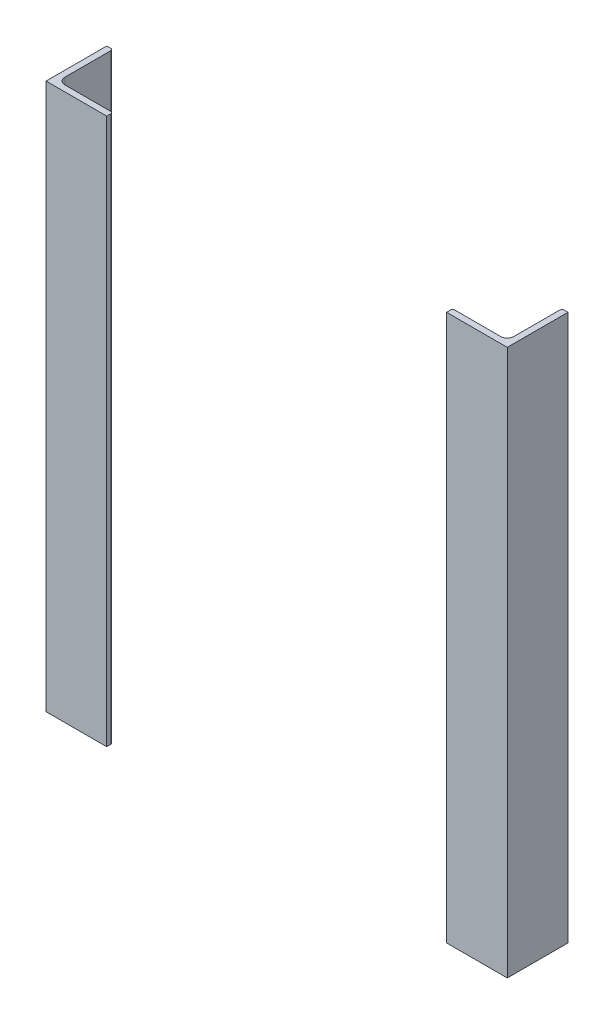
ISO-10303-21;
HEADER;
FILE_DESCRIPTION(('STEP AP214'),'2;1');
FILE_NAME('part.step','',(''),(''),'','','');
FILE_SCHEMA(('AUTOMOTIVE_DESIGN { 1 0 10303 214 1 1 1 1 }'));
ENDSEC;
DATA;
#1=APPLICATION_CONTEXT('core data for automotive mechanical design processes');
#2=APPLICATION_PROTOCOL_DEFINITION('international standard','automotive_design',2000,#1);
#3=PRODUCT_CONTEXT('',#1,'mechanical');
#4=PRODUCT('Part','Part','',(#3));
#5=PRODUCT_RELATED_PRODUCT_CATEGORY('part','',(#4));
#6=PRODUCT_DEFINITION_FORMATION('','',#4);
#7=PRODUCT_DEFINITION_CONTEXT('part definition',#1,'design');
#8=PRODUCT_DEFINITION('design','',#6,#7);
#9=PRODUCT_DEFINITION_SHAPE('','',#8);
#10=(LENGTH_UNIT() NAMED_UNIT(*) SI_UNIT(.MILLI.,.METRE.));
#11=(NAMED_UNIT(*) PLANE_ANGLE_UNIT() SI_UNIT($,.RADIAN.));
#12=(NAMED_UNIT(*) SI_UNIT($,.STERADIAN.) SOLID_ANGLE_UNIT());
#13=UNCERTAINTY_MEASURE_WITH_UNIT(LENGTH_MEASURE(1.E-05),#10,'distance_accuracy_value','');
#14=(GEOMETRIC_REPRESENTATION_CONTEXT(3) GLOBAL_UNCERTAINTY_ASSIGNED_CONTEXT((#13)) GLOBAL_UNIT_ASSIGNED_CONTEXT((#10,
#11,#12)) REPRESENTATION_CONTEXT('',''));
#15=CARTESIAN_POINT('',(0.,0.,0.));
#16=DIRECTION('',(0.,0.,1.));
#17=DIRECTION('',(1.,0.,0.));
#18=AXIS2_PLACEMENT_3D('',#15,#16,#17);
#19=CARTESIAN_POINT('',(190.000000000001,-450.,-50.));
#20=DIRECTION('',(0.,0.,1.));
#21=DIRECTION('',(1.,0.,0.));
#22=AXIS2_PLACEMENT_3D('',#19,#20,#21);
#23=PLANE('',#22);
#24=DIRECTION('',(1.,0.,0.));
#25=VECTOR('',#24,1.);
#26=CARTESIAN_POINT('',(190.000000000001,0.,-50.));
#27=LINE('',#26,#25);
#28=CARTESIAN_POINT('',(186.666700000001,0.,-50.));
#29=VERTEX_POINT('',#28);
#30=CARTESIAN_POINT('',(190.000000000001,0.,-50.));
#31=VERTEX_POINT('',#30);
#32=EDGE_CURVE('E183',#29,#31,#27,.T.);
#33=ORIENTED_EDGE('',*,*,#32,.T.);
#34=DIRECTION('',(0.,1.,0.));
#35=VECTOR('',#34,1.);
#36=CARTESIAN_POINT('',(190.000000000001,-450.,-50.));
#37=LINE('',#36,#35);
#38=CARTESIAN_POINT('',(190.000000000001,-450.,-50.));
#39=VERTEX_POINT('',#38);
#40=EDGE_CURVE('E14',#39,#31,#37,.T.);
#41=ORIENTED_EDGE('',*,*,#40,.F.);
#42=DIRECTION('',(1.,0.,0.));
#43=VECTOR('',#42,1.);
#44=CARTESIAN_POINT('',(190.000000000001,-450.,-50.));
#45=LINE('',#44,#43);
#46=CARTESIAN_POINT('',(186.666700000001,-450.,-50.));
#47=VERTEX_POINT('',#46);
#48=EDGE_CURVE('E199',#47,#39,#45,.T.);
#49=ORIENTED_EDGE('',*,*,#48,.F.);
#50=DIRECTION('',(0.,1.,0.));
#51=VECTOR('',#50,1.);
#52=CARTESIAN_POINT('',(186.666700000001,-450.,-50.));
#53=LINE('',#52,#51);
#54=EDGE_CURVE('E179',#47,#29,#53,.T.);
#55=ORIENTED_EDGE('',*,*,#54,.T.);
#56=EDGE_LOOP('',(#33,#41,#49,#55));
#57=FACE_BOUND('',#56,.T.);
#58=ADVANCED_FACE('F81',(#57),#23,.F.);
#59=CARTESIAN_POINT('',(190.000000000001,-450.,-50.));
#60=DIRECTION('',(-1.,0.,0.));
#61=DIRECTION('',(0.,0.,1.));
#62=AXIS2_PLACEMENT_3D('',#59,#60,#61);
#63=PLANE('',#62);
#64=DIRECTION('',(0.,0.,1.));
#65=VECTOR('',#64,1.);
#66=CARTESIAN_POINT('',(190.000000000001,0.,-50.));
#67=LINE('',#66,#65);
#68=CARTESIAN_POINT('',(190.,0.,0.));
#69=VERTEX_POINT('',#68);
#70=EDGE_CURVE('E186',#31,#69,#67,.T.);
#71=ORIENTED_EDGE('',*,*,#70,.T.);
#72=DIRECTION('',(0.,1.,0.));
#73=VECTOR('',#72,1.);
#74=CARTESIAN_POINT('',(190.,-450.,0.));
#75=LINE('',#74,#73);
#76=CARTESIAN_POINT('',(190.,-450.,0.));
#77=VERTEX_POINT('',#76);
#78=EDGE_CURVE('E89',#77,#69,#75,.T.);
#79=ORIENTED_EDGE('',*,*,#78,.F.);
#80=DIRECTION('',(0.,0.,1.));
#81=VECTOR('',#80,1.);
#82=CARTESIAN_POINT('',(190.000000000001,-450.,-50.));
#83=LINE('',#82,#81);
#84=EDGE_CURVE('E143',#39,#77,#83,.T.);
#85=ORIENTED_EDGE('',*,*,#84,.F.);
#86=ORIENTED_EDGE('',*,*,#40,.T.);
#87=EDGE_LOOP('',(#71,#79,#85,#86));
#88=FACE_BOUND('',#87,.T.);
#89=ADVANCED_FACE('F242',(#88),#63,.F.);
#90=CARTESIAN_POINT('',(190.,-450.,0.));
#91=DIRECTION('',(0.,0.,-1.));
#92=DIRECTION('',(-1.,0.,0.));
#93=AXIS2_PLACEMENT_3D('',#90,#91,#92);
#94=PLANE('',#93);
#95=DIRECTION('',(-1.,0.,0.));
#96=VECTOR('',#95,1.);
#97=CARTESIAN_POINT('',(190.,0.,0.));
#98=LINE('',#97,#96);
#99=CARTESIAN_POINT('',(140.,0.,-5.27355936696949E-13));
#100=VERTEX_POINT('',#99);
#101=EDGE_CURVE('E188',#69,#100,#98,.T.);
#102=ORIENTED_EDGE('',*,*,#101,.T.);
#103=DIRECTION('',(0.,1.,0.));
#104=VECTOR('',#103,1.);
#105=CARTESIAN_POINT('',(140.,-450.,-5.27355936696949E-13));
#106=LINE('',#105,#104);
#107=CARTESIAN_POINT('',(140.,-450.,-5.27355936696949E-13));
#108=VERTEX_POINT('',#107);
#109=EDGE_CURVE('E209',#108,#100,#106,.T.);
#110=ORIENTED_EDGE('',*,*,#109,.F.);
#111=DIRECTION('',(-1.,0.,0.));
#112=VECTOR('',#111,1.);
#113=CARTESIAN_POINT('',(190.,-450.,0.));
#114=LINE('',#113,#112);
#115=EDGE_CURVE('E217',#77,#108,#114,.T.);
#116=ORIENTED_EDGE('',*,*,#115,.F.);
#117=ORIENTED_EDGE('',*,*,#78,.T.);
#118=EDGE_LOOP('',(#102,#110,#116,#117));
#119=FACE_BOUND('',#118,.T.);
#120=ADVANCED_FACE('F215',(#119),#94,.F.);
#121=CARTESIAN_POINT('',(140.,-450.,-5.27355936696949E-13));
#122=DIRECTION('',(1.,0.,0.));
#123=DIRECTION('',(0.,0.,-1.));
#124=AXIS2_PLACEMENT_3D('',#121,#122,#123);
#125=PLANE('',#124);
#126=DIRECTION('',(0.,0.,-1.));
#127=VECTOR('',#126,1.);
#128=CARTESIAN_POINT('',(140.,0.,-5.27355936696949E-13));
#129=LINE('',#128,#127);
#130=CARTESIAN_POINT('',(140.,0.,-3.33330000000054));
#131=VERTEX_POINT('',#130);
#132=EDGE_CURVE('E190',#100,#131,#129,.T.);
#133=ORIENTED_EDGE('',*,*,#132,.T.);
#134=DIRECTION('',(0.,1.,0.));
#135=VECTOR('',#134,1.);
#136=CARTESIAN_POINT('',(140.,-450.,-3.33330000000054));
#137=LINE('',#136,#135);
#138=CARTESIAN_POINT('',(140.,-450.,-3.33330000000054));
#139=VERTEX_POINT('',#138);
#140=EDGE_CURVE('E206',#139,#131,#137,.T.);
#141=ORIENTED_EDGE('',*,*,#140,.F.);
#142=DIRECTION('',(0.,0.,-1.));
#143=VECTOR('',#142,1.);
#144=CARTESIAN_POINT('',(140.,-450.,-5.27355936696949E-13));
#145=LINE('',#144,#143);
#146=EDGE_CURVE('E233',#108,#139,#145,.T.);
#147=ORIENTED_EDGE('',*,*,#146,.F.);
#148=ORIENTED_EDGE('',*,*,#109,.T.);
#149=EDGE_LOOP('',(#133,#141,#147,#148));
#150=FACE_BOUND('',#149,.T.);
#151=ADVANCED_FACE('F226',(#150),#125,.F.);
#152=CARTESIAN_POINT('',(141.6667,-450.,-3.33330000000051));
#153=DIRECTION('',(0.,1.,0.));
#154=DIRECTION('',(-1.,0.,0.));
#155=AXIS2_PLACEMENT_3D('',#152,#153,#154);
#156=CYLINDRICAL_SURFACE('',#155,1.6667);
#157=CARTESIAN_POINT('',(141.6667,0.,-3.33330000000051));
#158=DIRECTION('',(0.,-1.,0.));
#159=DIRECTION('',(0.,0.,-1.));
#160=AXIS2_PLACEMENT_3D('',#157,#158,#159);
#161=CIRCLE('',#160,1.6667);
#162=CARTESIAN_POINT('',(141.6667,0.,-5.0000000000005));
#163=VERTEX_POINT('',#162);
#164=EDGE_CURVE('E192',#131,#163,#161,.T.);
#165=ORIENTED_EDGE('',*,*,#164,.T.);
#166=DIRECTION('',(0.,1.,0.));
#167=VECTOR('',#166,1.);
#168=CARTESIAN_POINT('',(141.6667,-450.,-5.0000000000005));
#169=LINE('',#168,#167);
#170=CARTESIAN_POINT('',(141.6667,-450.,-5.0000000000005));
#171=VERTEX_POINT('',#170);
#172=EDGE_CURVE('E203',#171,#163,#169,.T.);
#173=ORIENTED_EDGE('',*,*,#172,.F.);
#174=CARTESIAN_POINT('',(141.6667,-450.,-3.33330000000051));
#175=DIRECTION('',(0.,-1.,0.));
#176=DIRECTION('',(0.,0.,-1.));
#177=AXIS2_PLACEMENT_3D('',#174,#175,#176);
#178=CIRCLE('',#177,1.6667);
#179=EDGE_CURVE('E232',#139,#171,#178,.T.);
#180=ORIENTED_EDGE('',*,*,#179,.F.);
#181=ORIENTED_EDGE('',*,*,#140,.T.);
#182=EDGE_LOOP('',(#165,#173,#180,#181));
#183=FACE_BOUND('',#182,.T.);
#184=ADVANCED_FACE('F230',(#183),#156,.T.);
#185=CARTESIAN_POINT('',(179.5,-450.,-5.00000000000012));
#186=DIRECTION('',(0.,0.,1.));
#187=DIRECTION('',(1.,0.,0.));
#188=AXIS2_PLACEMENT_3D('',#185,#186,#187);
#189=PLANE('',#188);
#190=DIRECTION('',(1.,0.,0.));
#191=VECTOR('',#190,1.);
#192=CARTESIAN_POINT('',(179.5,0.,-5.00000000000012));
#193=LINE('',#192,#191);
#194=CARTESIAN_POINT('',(179.5,0.,-5.00000000000012));
#195=VERTEX_POINT('',#194);
#196=EDGE_CURVE('E194',#163,#195,#193,.T.);
#197=ORIENTED_EDGE('',*,*,#196,.T.);
#198=DIRECTION('',(0.,1.,0.));
#199=VECTOR('',#198,1.);
#200=CARTESIAN_POINT('',(179.5,-450.,-5.00000000000012));
#201=LINE('',#200,#199);
#202=CARTESIAN_POINT('',(179.5,-450.,-5.00000000000012));
#203=VERTEX_POINT('',#202);
#204=EDGE_CURVE('E174',#203,#195,#201,.T.);
#205=ORIENTED_EDGE('',*,*,#204,.F.);
#206=DIRECTION('',(1.,0.,0.));
#207=VECTOR('',#206,1.);
#208=CARTESIAN_POINT('',(179.5,-450.,-5.00000000000012));
#209=LINE('',#208,#207);
#210=EDGE_CURVE('E165',#171,#203,#209,.T.);
#211=ORIENTED_EDGE('',*,*,#210,.F.);
#212=ORIENTED_EDGE('',*,*,#172,.T.);
#213=EDGE_LOOP('',(#197,#205,#211,#212));
#214=FACE_BOUND('',#213,.T.);
#215=ADVANCED_FACE('F254',(#214),#189,.F.);
#216=CARTESIAN_POINT('',(179.5,-450.,-10.5000000000001));
#217=DIRECTION('',(0.,1.,0.));
#218=DIRECTION('',(-1.,0.,0.));
#219=AXIS2_PLACEMENT_3D('',#216,#217,#218);
#220=CYLINDRICAL_SURFACE('',#219,5.5);
#221=CARTESIAN_POINT('',(179.5,0.,-10.5000000000001));
#222=DIRECTION('',(0.,1.,0.));
#223=DIRECTION('',(0.,0.,-1.));
#224=AXIS2_PLACEMENT_3D('',#221,#222,#223);
#225=CIRCLE('',#224,5.5);
#226=CARTESIAN_POINT('',(185.,0.,-10.5000000000001));
#227=VERTEX_POINT('',#226);
#228=EDGE_CURVE('E173',#195,#227,#225,.T.);
#229=ORIENTED_EDGE('',*,*,#228,.T.);
#230=DIRECTION('',(0.,1.,0.));
#231=VECTOR('',#230,1.);
#232=CARTESIAN_POINT('',(185.,-450.,-10.5000000000001));
#233=LINE('',#232,#231);
#234=CARTESIAN_POINT('',(185.,-450.,-10.5000000000001));
#235=VERTEX_POINT('',#234);
#236=EDGE_CURVE('E170',#235,#227,#233,.T.);
#237=ORIENTED_EDGE('',*,*,#236,.F.);
#238=CARTESIAN_POINT('',(179.5,-450.,-10.5000000000001));
#239=DIRECTION('',(0.,1.,0.));
#240=DIRECTION('',(0.,0.,-1.));
#241=AXIS2_PLACEMENT_3D('',#238,#239,#240);
#242=CIRCLE('',#241,5.5);
#243=EDGE_CURVE('E159',#203,#235,#242,.T.);
#244=ORIENTED_EDGE('',*,*,#243,.F.);
#245=ORIENTED_EDGE('',*,*,#204,.T.);
#246=EDGE_LOOP('',(#229,#237,#244,#245));
#247=FACE_BOUND('',#246,.T.);
#248=ADVANCED_FACE('F171',(#247),#220,.F.);
#249=CARTESIAN_POINT('',(185.000000000001,-450.,-48.3333000000001));
#250=DIRECTION('',(1.,0.,0.));
#251=DIRECTION('',(0.,0.,-1.));
#252=AXIS2_PLACEMENT_3D('',#249,#250,#251);
#253=PLANE('',#252);
#254=DIRECTION('',(0.,0.,-1.));
#255=VECTOR('',#254,1.);
#256=CARTESIAN_POINT('',(185.000000000001,0.,-48.3333000000001));
#257=LINE('',#256,#255);
#258=CARTESIAN_POINT('',(185.000000000001,0.,-48.3333000000001));
#259=VERTEX_POINT('',#258);
#260=EDGE_CURVE('E129',#227,#259,#257,.T.);
#261=ORIENTED_EDGE('',*,*,#260,.T.);
#262=DIRECTION('',(0.,1.,0.));
#263=VECTOR('',#262,1.);
#264=CARTESIAN_POINT('',(185.000000000001,-450.,-48.3333000000001));
#265=LINE('',#264,#263);
#266=CARTESIAN_POINT('',(185.000000000001,-450.,-48.3333000000001));
#267=VERTEX_POINT('',#266);
#268=EDGE_CURVE('E175',#267,#259,#265,.T.);
#269=ORIENTED_EDGE('',*,*,#268,.F.);
#270=DIRECTION('',(0.,0.,-1.));
#271=VECTOR('',#270,1.);
#272=CARTESIAN_POINT('',(185.000000000001,-450.,-48.3333000000001));
#273=LINE('',#272,#271);
#274=EDGE_CURVE('E163',#235,#267,#273,.T.);
#275=ORIENTED_EDGE('',*,*,#274,.F.);
#276=ORIENTED_EDGE('',*,*,#236,.T.);
#277=EDGE_LOOP('',(#261,#269,#275,#276));
#278=FACE_BOUND('',#277,.T.);
#279=ADVANCED_FACE('F177',(#278),#253,.F.);
#280=CARTESIAN_POINT('',(186.666700000001,-450.,-48.3333));
#281=DIRECTION('',(0.,1.,0.));
#282=DIRECTION('',(-1.,0.,0.));
#283=AXIS2_PLACEMENT_3D('',#280,#281,#282);
#284=CYLINDRICAL_SURFACE('',#283,1.6667);
#285=CARTESIAN_POINT('',(186.666700000001,0.,-48.3333));
#286=DIRECTION('',(0.,-1.,0.));
#287=DIRECTION('',(0.,0.,1.));
#288=AXIS2_PLACEMENT_3D('',#285,#286,#287);
#289=CIRCLE('',#288,1.6667);
#290=EDGE_CURVE('E135',#259,#29,#289,.T.);
#291=ORIENTED_EDGE('',*,*,#290,.T.);
#292=ORIENTED_EDGE('',*,*,#54,.F.);
#293=CARTESIAN_POINT('',(186.666700000001,-450.,-48.3333));
#294=DIRECTION('',(0.,-1.,0.));
#295=DIRECTION('',(0.,0.,1.));
#296=AXIS2_PLACEMENT_3D('',#293,#294,#295);
#297=CIRCLE('',#296,1.6667);
#298=EDGE_CURVE('E97',#267,#47,#297,.T.);
#299=ORIENTED_EDGE('',*,*,#298,.F.);
#300=ORIENTED_EDGE('',*,*,#268,.T.);
#301=EDGE_LOOP('',(#291,#292,#299,#300));
#302=FACE_BOUND('',#301,.T.);
#303=ADVANCED_FACE('F262',(#302),#284,.T.);
#304=CARTESIAN_POINT('',(186.666700000001,-450.,-48.3333));
#305=DIRECTION('',(0.,1.,0.));
#306=DIRECTION('',(0.,0.,1.));
#307=AXIS2_PLACEMENT_3D('',#304,#305,#306);
#308=PLANE('',#307);
#309=ORIENTED_EDGE('',*,*,#48,.T.);
#310=ORIENTED_EDGE('',*,*,#84,.T.);
#311=ORIENTED_EDGE('',*,*,#115,.T.);
#312=ORIENTED_EDGE('',*,*,#146,.T.);
#313=ORIENTED_EDGE('',*,*,#179,.T.);
#314=ORIENTED_EDGE('',*,*,#210,.T.);
#315=ORIENTED_EDGE('',*,*,#243,.T.);
#316=ORIENTED_EDGE('',*,*,#274,.T.);
#317=ORIENTED_EDGE('',*,*,#298,.T.);
#318=EDGE_LOOP('',(#309,#310,#311,#312,#313,#314,#315,#316,#317));
#319=FACE_BOUND('',#318,.T.);
#320=ADVANCED_FACE('F161',(#319),#308,.F.);
#321=CARTESIAN_POINT('',(186.666700000001,0.,-48.3333));
#322=DIRECTION('',(0.,1.,0.));
#323=DIRECTION('',(0.,0.,1.));
#324=AXIS2_PLACEMENT_3D('',#321,#322,#323);
#325=PLANE('',#324);
#326=ORIENTED_EDGE('',*,*,#32,.F.);
#327=ORIENTED_EDGE('',*,*,#290,.F.);
#328=ORIENTED_EDGE('',*,*,#260,.F.);
#329=ORIENTED_EDGE('',*,*,#228,.F.);
#330=ORIENTED_EDGE('',*,*,#196,.F.);
#331=ORIENTED_EDGE('',*,*,#164,.F.);
#332=ORIENTED_EDGE('',*,*,#132,.F.);
#333=ORIENTED_EDGE('',*,*,#101,.F.);
#334=ORIENTED_EDGE('',*,*,#70,.F.);
#335=EDGE_LOOP('',(#326,#327,#328,#329,#330,#331,#332,#333,#334));
#336=FACE_BOUND('',#335,.T.);
#337=ADVANCED_FACE('F221',(#336),#325,.T.);
#338=CLOSED_SHELL('',(#58,#89,#120,#151,#184,#215,#248,#279,#303,#320,#337));
#339=MANIFOLD_SOLID_BREP('B2',#338);
#340=CARTESIAN_POINT('',(-140.,-450.,0.));
#341=DIRECTION('',(-1.,0.,0.));
#342=DIRECTION('',(0.,-1.,0.));
#343=AXIS2_PLACEMENT_3D('',#340,#341,#342);
#344=PLANE('',#343);
#345=DIRECTION('',(0.,0.,1.));
#346=VECTOR('',#345,1.);
#347=CARTESIAN_POINT('',(-140.,0.,0.));
#348=LINE('',#347,#346);
#349=CARTESIAN_POINT('',(-140.,0.,-3.3333));
#350=VERTEX_POINT('',#349);
#351=CARTESIAN_POINT('',(-140.,0.,0.));
#352=VERTEX_POINT('',#351);
#353=EDGE_CURVE('E464',#350,#352,#348,.T.);
#354=ORIENTED_EDGE('',*,*,#353,.T.);
#355=DIRECTION('',(0.,1.,0.));
#356=VECTOR('',#355,1.);
#357=CARTESIAN_POINT('',(-140.,-450.,0.));
#358=LINE('',#357,#356);
#359=CARTESIAN_POINT('',(-140.,-450.,0.));
#360=VERTEX_POINT('',#359);
#361=EDGE_CURVE('E79',#360,#352,#358,.T.);
#362=ORIENTED_EDGE('',*,*,#361,.F.);
#363=DIRECTION('',(0.,0.,1.));
#364=VECTOR('',#363,1.);
#365=CARTESIAN_POINT('',(-140.,-450.,0.));
#366=LINE('',#365,#364);
#367=CARTESIAN_POINT('',(-140.,-450.,-3.3333));
#368=VERTEX_POINT('',#367);
#369=EDGE_CURVE('E489',#368,#360,#366,.T.);
#370=ORIENTED_EDGE('',*,*,#369,.F.);
#371=DIRECTION('',(0.,1.,0.));
#372=VECTOR('',#371,1.);
#373=CARTESIAN_POINT('',(-140.,-450.,-3.3333));
#374=LINE('',#373,#372);
#375=EDGE_CURVE('E460',#368,#350,#374,.T.);
#376=ORIENTED_EDGE('',*,*,#375,.T.);
#377=EDGE_LOOP('',(#354,#362,#370,#376));
#378=FACE_BOUND('',#377,.T.);
#379=ADVANCED_FACE('F357',(#378),#344,.F.);
#380=CARTESIAN_POINT('',(-140.,-450.,0.));
#381=DIRECTION('',(0.,0.,-1.));
#382=DIRECTION('',(-1.,0.,0.));
#383=AXIS2_PLACEMENT_3D('',#380,#381,#382);
#384=PLANE('',#383);
#385=DIRECTION('',(-1.,0.,0.));
#386=VECTOR('',#385,1.);
#387=CARTESIAN_POINT('',(-140.,0.,0.));
#388=LINE('',#387,#386);
#389=CARTESIAN_POINT('',(-190.,0.,0.));
#390=VERTEX_POINT('',#389);
#391=EDGE_CURVE('E468',#352,#390,#388,.T.);
#392=ORIENTED_EDGE('',*,*,#391,.T.);
#393=DIRECTION('',(0.,1.,0.));
#394=VECTOR('',#393,1.);
#395=CARTESIAN_POINT('',(-190.,-450.,0.));
#396=LINE('',#395,#394);
#397=CARTESIAN_POINT('',(-190.,-450.,0.));
#398=VERTEX_POINT('',#397);
#399=EDGE_CURVE('E366',#398,#390,#396,.T.);
#400=ORIENTED_EDGE('',*,*,#399,.F.);
#401=DIRECTION('',(-1.,0.,0.));
#402=VECTOR('',#401,1.);
#403=CARTESIAN_POINT('',(-140.,-450.,0.));
#404=LINE('',#403,#402);
#405=EDGE_CURVE('E420',#360,#398,#404,.T.);
#406=ORIENTED_EDGE('',*,*,#405,.F.);
#407=ORIENTED_EDGE('',*,*,#361,.T.);
#408=EDGE_LOOP('',(#392,#400,#406,#407));
#409=FACE_BOUND('',#408,.T.);
#410=ADVANCED_FACE('F545',(#409),#384,.F.);
#411=CARTESIAN_POINT('',(-190.,-450.,0.));
#412=DIRECTION('',(1.,0.,0.));
#413=DIRECTION('',(0.,1.,0.));
#414=AXIS2_PLACEMENT_3D('',#411,#412,#413);
#415=PLANE('',#414);
#416=DIRECTION('',(0.,0.,-1.));
#417=VECTOR('',#416,1.);
#418=CARTESIAN_POINT('',(-190.,0.,0.));
#419=LINE('',#418,#417);
#420=CARTESIAN_POINT('',(-190.,0.,-50.));
#421=VERTEX_POINT('',#420);
#422=EDGE_CURVE('E471',#390,#421,#419,.T.);
#423=ORIENTED_EDGE('',*,*,#422,.T.);
#424=DIRECTION('',(0.,1.,0.));
#425=VECTOR('',#424,1.);
#426=CARTESIAN_POINT('',(-190.,-450.,-50.));
#427=LINE('',#426,#425);
#428=CARTESIAN_POINT('',(-190.,-450.,-50.));
#429=VERTEX_POINT('',#428);
#430=EDGE_CURVE('E504',#429,#421,#427,.T.);
#431=ORIENTED_EDGE('',*,*,#430,.F.);
#432=DIRECTION('',(0.,0.,-1.));
#433=VECTOR('',#432,1.);
#434=CARTESIAN_POINT('',(-190.,-450.,0.));
#435=LINE('',#434,#433);
#436=EDGE_CURVE('E514',#398,#429,#435,.T.);
#437=ORIENTED_EDGE('',*,*,#436,.F.);
#438=ORIENTED_EDGE('',*,*,#399,.T.);
#439=EDGE_LOOP('',(#423,#431,#437,#438));
#440=FACE_BOUND('',#439,.T.);
#441=ADVANCED_FACE('F512',(#440),#415,.F.);
#442=CARTESIAN_POINT('',(-190.,-450.,-50.));
#443=DIRECTION('',(0.,0.,1.));
#444=DIRECTION('',(1.,0.,0.));
#445=AXIS2_PLACEMENT_3D('',#442,#443,#444);
#446=PLANE('',#445);
#447=DIRECTION('',(1.,0.,0.));
#448=VECTOR('',#447,1.);
#449=CARTESIAN_POINT('',(-190.,0.,-50.));
#450=LINE('',#449,#448);
#451=CARTESIAN_POINT('',(-186.6667,0.,-50.));
#452=VERTEX_POINT('',#451);
#453=EDGE_CURVE('E474',#421,#452,#450,.T.);
#454=ORIENTED_EDGE('',*,*,#453,.T.);
#455=DIRECTION('',(0.,1.,0.));
#456=VECTOR('',#455,1.);
#457=CARTESIAN_POINT('',(-186.6667,-450.,-50.));
#458=LINE('',#457,#456);
#459=CARTESIAN_POINT('',(-186.6667,-450.,-50.));
#460=VERTEX_POINT('',#459);
#461=EDGE_CURVE('E500',#460,#452,#458,.T.);
#462=ORIENTED_EDGE('',*,*,#461,.F.);
#463=DIRECTION('',(1.,0.,0.));
#464=VECTOR('',#463,1.);
#465=CARTESIAN_POINT('',(-190.,-450.,-50.));
#466=LINE('',#465,#464);
#467=EDGE_CURVE('E531',#429,#460,#466,.T.);
#468=ORIENTED_EDGE('',*,*,#467,.F.);
#469=ORIENTED_EDGE('',*,*,#430,.T.);
#470=EDGE_LOOP('',(#454,#462,#468,#469));
#471=FACE_BOUND('',#470,.T.);
#472=ADVANCED_FACE('F523',(#471),#446,.F.);
#473=CARTESIAN_POINT('',(-186.6667,-450.,-48.3333));
#474=DIRECTION('',(0.,1.,0.));
#475=DIRECTION('',(-1.,0.,0.));
#476=AXIS2_PLACEMENT_3D('',#473,#474,#475);
#477=CYLINDRICAL_SURFACE('',#476,1.6667);
#478=CARTESIAN_POINT('',(-186.6667,0.,-48.3333));
#479=DIRECTION('',(0.,-1.,0.));
#480=DIRECTION('',(1.,0.,0.));
#481=AXIS2_PLACEMENT_3D('',#478,#479,#480);
#482=CIRCLE('',#481,1.6667);
#483=CARTESIAN_POINT('',(-185.,0.,-48.3333));
#484=VERTEX_POINT('',#483);
#485=EDGE_CURVE('E477',#452,#484,#482,.T.);
#486=ORIENTED_EDGE('',*,*,#485,.T.);
#487=DIRECTION('',(0.,1.,0.));
#488=VECTOR('',#487,1.);
#489=CARTESIAN_POINT('',(-185.,-450.,-48.3333));
#490=LINE('',#489,#488);
#491=CARTESIAN_POINT('',(-185.,-450.,-48.3333));
#492=VERTEX_POINT('',#491);
#493=EDGE_CURVE('E496',#492,#484,#490,.T.);
#494=ORIENTED_EDGE('',*,*,#493,.F.);
#495=CARTESIAN_POINT('',(-186.6667,-450.,-48.3333));
#496=DIRECTION('',(0.,-1.,0.));
#497=DIRECTION('',(1.,0.,0.));
#498=AXIS2_PLACEMENT_3D('',#495,#496,#497);
#499=CIRCLE('',#498,1.6667);
#500=EDGE_CURVE('E529',#460,#492,#499,.T.);
#501=ORIENTED_EDGE('',*,*,#500,.F.);
#502=ORIENTED_EDGE('',*,*,#461,.T.);
#503=EDGE_LOOP('',(#486,#494,#501,#502));
#504=FACE_BOUND('',#503,.T.);
#505=ADVANCED_FACE('F527',(#504),#477,.T.);
#506=CARTESIAN_POINT('',(-185.,-450.,-10.5));
#507=DIRECTION('',(-1.,0.,0.));
#508=DIRECTION('',(0.,-1.,0.));
#509=AXIS2_PLACEMENT_3D('',#506,#507,#508);
#510=PLANE('',#509);
#511=DIRECTION('',(0.,0.,1.));
#512=VECTOR('',#511,1.);
#513=CARTESIAN_POINT('',(-185.,0.,-10.5));
#514=LINE('',#513,#512);
#515=CARTESIAN_POINT('',(-185.,0.,-10.5));
#516=VERTEX_POINT('',#515);
#517=EDGE_CURVE('E480',#484,#516,#514,.T.);
#518=ORIENTED_EDGE('',*,*,#517,.T.);
#519=DIRECTION('',(0.,1.,0.));
#520=VECTOR('',#519,1.);
#521=CARTESIAN_POINT('',(-185.,-450.,-10.5));
#522=LINE('',#521,#520);
#523=CARTESIAN_POINT('',(-185.,-450.,-10.5));
#524=VERTEX_POINT('',#523);
#525=EDGE_CURVE('E453',#524,#516,#522,.T.);
#526=ORIENTED_EDGE('',*,*,#525,.F.);
#527=DIRECTION('',(0.,0.,1.));
#528=VECTOR('',#527,1.);
#529=CARTESIAN_POINT('',(-185.,-450.,-10.5));
#530=LINE('',#529,#528);
#531=EDGE_CURVE('E442',#492,#524,#530,.T.);
#532=ORIENTED_EDGE('',*,*,#531,.F.);
#533=ORIENTED_EDGE('',*,*,#493,.T.);
#534=EDGE_LOOP('',(#518,#526,#532,#533));
#535=FACE_BOUND('',#534,.T.);
#536=ADVANCED_FACE('F557',(#535),#510,.F.);
#537=CARTESIAN_POINT('',(-179.5,-450.,-10.5));
#538=DIRECTION('',(0.,1.,0.));
#539=DIRECTION('',(-1.,0.,0.));
#540=AXIS2_PLACEMENT_3D('',#537,#538,#539);
#541=CYLINDRICAL_SURFACE('',#540,5.5);
#542=CARTESIAN_POINT('',(-179.5,0.,-10.5));
#543=DIRECTION('',(0.,1.,0.));
#544=DIRECTION('',(1.,0.,0.));
#545=AXIS2_PLACEMENT_3D('',#542,#543,#544);
#546=CIRCLE('',#545,5.5);
#547=CARTESIAN_POINT('',(-179.5,0.,-5.));
#548=VERTEX_POINT('',#547);
#549=EDGE_CURVE('E451',#516,#548,#546,.T.);
#550=ORIENTED_EDGE('',*,*,#549,.T.);
#551=DIRECTION('',(0.,1.,0.));
#552=VECTOR('',#551,1.);
#553=CARTESIAN_POINT('',(-179.5,-450.,-5.));
#554=LINE('',#553,#552);
#555=CARTESIAN_POINT('',(-179.5,-450.,-5.));
#556=VERTEX_POINT('',#555);
#557=EDGE_CURVE('E448',#556,#548,#554,.T.);
#558=ORIENTED_EDGE('',*,*,#557,.F.);
#559=CARTESIAN_POINT('',(-179.5,-450.,-10.5));
#560=DIRECTION('',(0.,1.,0.));
#561=DIRECTION('',(1.,0.,0.));
#562=AXIS2_PLACEMENT_3D('',#559,#560,#561);
#563=CIRCLE('',#562,5.5);
#564=EDGE_CURVE('E436',#524,#556,#563,.T.);
#565=ORIENTED_EDGE('',*,*,#564,.F.);
#566=ORIENTED_EDGE('',*,*,#525,.T.);
#567=EDGE_LOOP('',(#550,#558,#565,#566));
#568=FACE_BOUND('',#567,.T.);
#569=ADVANCED_FACE('F449',(#568),#541,.F.);
#570=CARTESIAN_POINT('',(-141.6667,-450.,-5.));
#571=DIRECTION('',(0.,0.,1.));
#572=DIRECTION('',(1.,0.,0.));
#573=AXIS2_PLACEMENT_3D('',#570,#571,#572);
#574=PLANE('',#573);
#575=DIRECTION('',(1.,0.,0.));
#576=VECTOR('',#575,1.);
#577=CARTESIAN_POINT('',(-141.6667,0.,-5.));
#578=LINE('',#577,#576);
#579=CARTESIAN_POINT('',(-141.6667,0.,-5.));
#580=VERTEX_POINT('',#579);
#581=EDGE_CURVE('E406',#548,#580,#578,.T.);
#582=ORIENTED_EDGE('',*,*,#581,.T.);
#583=DIRECTION('',(0.,1.,0.));
#584=VECTOR('',#583,1.);
#585=CARTESIAN_POINT('',(-141.6667,-450.,-5.));
#586=LINE('',#585,#584);
#587=CARTESIAN_POINT('',(-141.6667,-450.,-5.));
#588=VERTEX_POINT('',#587);
#589=EDGE_CURVE('E454',#588,#580,#586,.T.);
#590=ORIENTED_EDGE('',*,*,#589,.F.);
#591=DIRECTION('',(1.,0.,0.));
#592=VECTOR('',#591,1.);
#593=CARTESIAN_POINT('',(-141.6667,-450.,-5.));
#594=LINE('',#593,#592);
#595=EDGE_CURVE('E440',#556,#588,#594,.T.);
#596=ORIENTED_EDGE('',*,*,#595,.F.);
#597=ORIENTED_EDGE('',*,*,#557,.T.);
#598=EDGE_LOOP('',(#582,#590,#596,#597));
#599=FACE_BOUND('',#598,.T.);
#600=ADVANCED_FACE('F456',(#599),#574,.F.);
#601=CARTESIAN_POINT('',(-141.6667,-450.,-3.3333));
#602=DIRECTION('',(0.,1.,0.));
#603=DIRECTION('',(-1.,0.,0.));
#604=AXIS2_PLACEMENT_3D('',#601,#602,#603);
#605=CYLINDRICAL_SURFACE('',#604,1.6667);
#606=CARTESIAN_POINT('',(-141.6667,0.,-3.3333));
#607=DIRECTION('',(0.,-1.,0.));
#608=DIRECTION('',(-1.,0.,0.));
#609=AXIS2_PLACEMENT_3D('',#606,#607,#608);
#610=CIRCLE('',#609,1.6667);
#611=EDGE_CURVE('E412',#580,#350,#610,.T.);
#612=ORIENTED_EDGE('',*,*,#611,.T.);
#613=ORIENTED_EDGE('',*,*,#375,.F.);
#614=CARTESIAN_POINT('',(-141.6667,-450.,-3.3333));
#615=DIRECTION('',(0.,-1.,0.));
#616=DIRECTION('',(-1.,0.,0.));
#617=AXIS2_PLACEMENT_3D('',#614,#615,#616);
#618=CIRCLE('',#617,1.6667);
#619=EDGE_CURVE('E374',#588,#368,#618,.T.);
#620=ORIENTED_EDGE('',*,*,#619,.F.);
#621=ORIENTED_EDGE('',*,*,#589,.T.);
#622=EDGE_LOOP('',(#612,#613,#620,#621));
#623=FACE_BOUND('',#622,.T.);
#624=ADVANCED_FACE('F565',(#623),#605,.T.);
#625=CARTESIAN_POINT('',(-141.6667,-450.,-3.3333));
#626=DIRECTION('',(0.,1.,0.));
#627=DIRECTION('',(-1.,0.,0.));
#628=AXIS2_PLACEMENT_3D('',#625,#626,#627);
#629=PLANE('',#628);
#630=ORIENTED_EDGE('',*,*,#369,.T.);
#631=ORIENTED_EDGE('',*,*,#405,.T.);
#632=ORIENTED_EDGE('',*,*,#436,.T.);
#633=ORIENTED_EDGE('',*,*,#467,.T.);
#634=ORIENTED_EDGE('',*,*,#500,.T.);
#635=ORIENTED_EDGE('',*,*,#531,.T.);
#636=ORIENTED_EDGE('',*,*,#564,.T.);
#637=ORIENTED_EDGE('',*,*,#595,.T.);
#638=ORIENTED_EDGE('',*,*,#619,.T.);
#639=EDGE_LOOP('',(#630,#631,#632,#633,#634,#635,#636,#637,#638));
#640=FACE_BOUND('',#639,.T.);
#641=ADVANCED_FACE('F438',(#640),#629,.F.);
#642=CARTESIAN_POINT('',(-141.6667,0.,-3.3333));
#643=DIRECTION('',(0.,1.,0.));
#644=DIRECTION('',(-1.,0.,0.));
#645=AXIS2_PLACEMENT_3D('',#642,#643,#644);
#646=PLANE('',#645);
#647=ORIENTED_EDGE('',*,*,#353,.F.);
#648=ORIENTED_EDGE('',*,*,#611,.F.);
#649=ORIENTED_EDGE('',*,*,#581,.F.);
#650=ORIENTED_EDGE('',*,*,#549,.F.);
#651=ORIENTED_EDGE('',*,*,#517,.F.);
#652=ORIENTED_EDGE('',*,*,#485,.F.);
#653=ORIENTED_EDGE('',*,*,#453,.F.);
#654=ORIENTED_EDGE('',*,*,#422,.F.);
#655=ORIENTED_EDGE('',*,*,#391,.F.);
#656=EDGE_LOOP('',(#647,#648,#649,#650,#651,#652,#653,#654,#655));
#657=FACE_BOUND('',#656,.T.);
#658=ADVANCED_FACE('F518',(#657),#646,.T.);
#659=CLOSED_SHELL('',(#379,#410,#441,#472,#505,#536,#569,#600,#624,#641,#658));
#660=MANIFOLD_SOLID_BREP('B8',#659);
#661=ADVANCED_BREP_SHAPE_REPRESENTATION('',(#18,#339,#660),#14);
#662=SHAPE_DEFINITION_REPRESENTATION(#9,#661);
ENDSEC;
END-ISO-10303-21;
